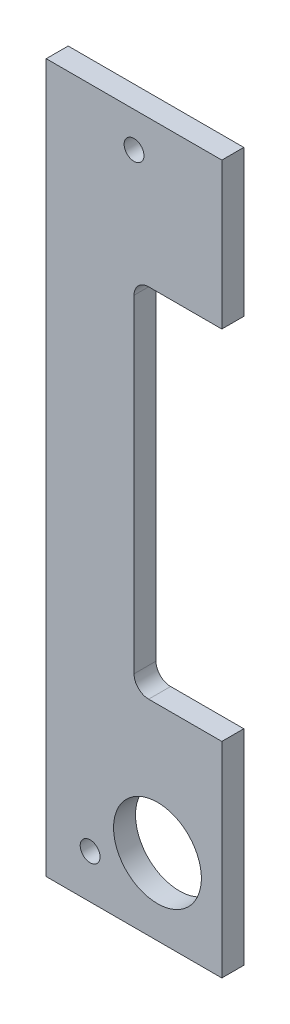
ISO-10303-21;
HEADER;
FILE_DESCRIPTION(('STEP AP214'),'2;1');
FILE_NAME('part.step','',(''),(''),'','','');
FILE_SCHEMA(('AUTOMOTIVE_DESIGN { 1 0 10303 214 1 1 1 1 }'));
ENDSEC;
DATA;
#1=APPLICATION_CONTEXT('core data for automotive mechanical design processes');
#2=APPLICATION_PROTOCOL_DEFINITION('international standard','automotive_design',2000,#1);
#3=PRODUCT_CONTEXT('',#1,'mechanical');
#4=PRODUCT('Part','Part','',(#3));
#5=PRODUCT_RELATED_PRODUCT_CATEGORY('part','',(#4));
#6=PRODUCT_DEFINITION_FORMATION('','',#4);
#7=PRODUCT_DEFINITION_CONTEXT('part definition',#1,'design');
#8=PRODUCT_DEFINITION('design','',#6,#7);
#9=PRODUCT_DEFINITION_SHAPE('','',#8);
#10=(LENGTH_UNIT() NAMED_UNIT(*) SI_UNIT(.MILLI.,.METRE.));
#11=(NAMED_UNIT(*) PLANE_ANGLE_UNIT() SI_UNIT($,.RADIAN.));
#12=(NAMED_UNIT(*) SI_UNIT($,.STERADIAN.) SOLID_ANGLE_UNIT());
#13=UNCERTAINTY_MEASURE_WITH_UNIT(LENGTH_MEASURE(1.E-05),#10,'distance_accuracy_value','');
#14=(GEOMETRIC_REPRESENTATION_CONTEXT(3) GLOBAL_UNCERTAINTY_ASSIGNED_CONTEXT((#13)) GLOBAL_UNIT_ASSIGNED_CONTEXT((#10,
#11,#12)) REPRESENTATION_CONTEXT('',''));
#15=CARTESIAN_POINT('',(0.,0.,0.));
#16=DIRECTION('',(0.,0.,1.));
#17=DIRECTION('',(1.,0.,0.));
#18=AXIS2_PLACEMENT_3D('',#15,#16,#17);
#19=CARTESIAN_POINT('',(0.,0.,-4.7625));
#20=DIRECTION('',(1.,0.,0.));
#21=DIRECTION('',(0.,1.,0.));
#22=AXIS2_PLACEMENT_3D('',#19,#20,#21);
#23=PLANE('',#22);
#24=DIRECTION('',(0.,1.,0.));
#25=VECTOR('',#24,1.);
#26=CARTESIAN_POINT('',(0.,0.,0.));
#27=LINE('',#26,#25);
#28=CARTESIAN_POINT('',(0.,0.,0.));
#29=VERTEX_POINT('',#28);
#30=CARTESIAN_POINT('',(0.,44.45,0.));
#31=VERTEX_POINT('',#30);
#32=EDGE_CURVE('E141',#29,#31,#27,.T.);
#33=ORIENTED_EDGE('',*,*,#32,.F.);
#34=DIRECTION('',(0.,0.,1.));
#35=VECTOR('',#34,1.);
#36=CARTESIAN_POINT('',(0.,0.,-4.7625));
#37=LINE('',#36,#35);
#38=CARTESIAN_POINT('',(0.,0.,-4.7625));
#39=VERTEX_POINT('',#38);
#40=EDGE_CURVE('E11',#39,#29,#37,.T.);
#41=ORIENTED_EDGE('',*,*,#40,.F.);
#42=DIRECTION('',(0.,1.,0.));
#43=VECTOR('',#42,1.);
#44=CARTESIAN_POINT('',(0.,0.,-4.7625));
#45=LINE('',#44,#43);
#46=CARTESIAN_POINT('',(0.,44.45,-4.7625));
#47=VERTEX_POINT('',#46);
#48=EDGE_CURVE('E168',#39,#47,#45,.T.);
#49=ORIENTED_EDGE('',*,*,#48,.T.);
#50=DIRECTION('',(0.,0.,1.));
#51=VECTOR('',#50,1.);
#52=CARTESIAN_POINT('',(0.,44.45,-4.7625));
#53=LINE('',#52,#51);
#54=EDGE_CURVE('E35',#47,#31,#53,.T.);
#55=ORIENTED_EDGE('',*,*,#54,.T.);
#56=EDGE_LOOP('',(#33,#41,#49,#55));
#57=FACE_BOUND('',#56,.T.);
#58=ADVANCED_FACE('F32',(#57),#23,.T.);
#59=CARTESIAN_POINT('',(-38.1,0.,-4.7625));
#60=DIRECTION('',(0.,-1.,0.));
#61=DIRECTION('',(1.,0.,0.));
#62=AXIS2_PLACEMENT_3D('',#59,#60,#61);
#63=PLANE('',#62);
#64=DIRECTION('',(1.,0.,0.));
#65=VECTOR('',#64,1.);
#66=CARTESIAN_POINT('',(-38.1,0.,0.));
#67=LINE('',#66,#65);
#68=CARTESIAN_POINT('',(-38.1,0.,0.));
#69=VERTEX_POINT('',#68);
#70=EDGE_CURVE('E166',#69,#29,#67,.T.);
#71=ORIENTED_EDGE('',*,*,#70,.F.);
#72=DIRECTION('',(0.,0.,1.));
#73=VECTOR('',#72,1.);
#74=CARTESIAN_POINT('',(-38.1,0.,-4.7625));
#75=LINE('',#74,#73);
#76=CARTESIAN_POINT('',(-38.1,0.,-4.7625));
#77=VERTEX_POINT('',#76);
#78=EDGE_CURVE('E41',#77,#69,#75,.T.);
#79=ORIENTED_EDGE('',*,*,#78,.F.);
#80=DIRECTION('',(1.,0.,0.));
#81=VECTOR('',#80,1.);
#82=CARTESIAN_POINT('',(-38.1,0.,-4.7625));
#83=LINE('',#82,#81);
#84=EDGE_CURVE('E131',#77,#39,#83,.T.);
#85=ORIENTED_EDGE('',*,*,#84,.T.);
#86=ORIENTED_EDGE('',*,*,#40,.T.);
#87=EDGE_LOOP('',(#71,#79,#85,#86));
#88=FACE_BOUND('',#87,.T.);
#89=ADVANCED_FACE('F184',(#88),#63,.T.);
#90=CARTESIAN_POINT('',(-38.1,153.67,-4.7625));
#91=DIRECTION('',(-1.,0.,0.));
#92=DIRECTION('',(0.,0.,1.));
#93=AXIS2_PLACEMENT_3D('',#90,#91,#92);
#94=PLANE('',#93);
#95=DIRECTION('',(0.,-1.,0.));
#96=VECTOR('',#95,1.);
#97=CARTESIAN_POINT('',(-38.1,153.67,0.));
#98=LINE('',#97,#96);
#99=CARTESIAN_POINT('',(-38.1,153.67,0.));
#100=VERTEX_POINT('',#99);
#101=EDGE_CURVE('E118',#100,#69,#98,.T.);
#102=ORIENTED_EDGE('',*,*,#101,.F.);
#103=DIRECTION('',(0.,0.,1.));
#104=VECTOR('',#103,1.);
#105=CARTESIAN_POINT('',(-38.1,153.67,-4.7625));
#106=LINE('',#105,#104);
#107=CARTESIAN_POINT('',(-38.1,153.67,-4.7625));
#108=VERTEX_POINT('',#107);
#109=EDGE_CURVE('E113',#108,#100,#106,.T.);
#110=ORIENTED_EDGE('',*,*,#109,.F.);
#111=DIRECTION('',(0.,-1.,0.));
#112=VECTOR('',#111,1.);
#113=CARTESIAN_POINT('',(-38.1,153.67,-4.7625));
#114=LINE('',#113,#112);
#115=EDGE_CURVE('E116',#108,#77,#114,.T.);
#116=ORIENTED_EDGE('',*,*,#115,.T.);
#117=ORIENTED_EDGE('',*,*,#78,.T.);
#118=EDGE_LOOP('',(#102,#110,#116,#117));
#119=FACE_BOUND('',#118,.T.);
#120=ADVANCED_FACE('F115',(#119),#94,.T.);
#121=CARTESIAN_POINT('',(0.,153.67,-4.7625));
#122=DIRECTION('',(0.,1.,0.));
#123=DIRECTION('',(0.,0.,1.));
#124=AXIS2_PLACEMENT_3D('',#121,#122,#123);
#125=PLANE('',#124);
#126=DIRECTION('',(-1.,0.,0.));
#127=VECTOR('',#126,1.);
#128=CARTESIAN_POINT('',(0.,153.67,0.));
#129=LINE('',#128,#127);
#130=CARTESIAN_POINT('',(0.,153.67,0.));
#131=VERTEX_POINT('',#130);
#132=EDGE_CURVE('E163',#131,#100,#129,.T.);
#133=ORIENTED_EDGE('',*,*,#132,.F.);
#134=DIRECTION('',(0.,0.,1.));
#135=VECTOR('',#134,1.);
#136=CARTESIAN_POINT('',(0.,153.67,-4.7625));
#137=LINE('',#136,#135);
#138=CARTESIAN_POINT('',(0.,153.67,-4.7625));
#139=VERTEX_POINT('',#138);
#140=EDGE_CURVE('E123',#139,#131,#137,.T.);
#141=ORIENTED_EDGE('',*,*,#140,.F.);
#142=DIRECTION('',(-1.,0.,0.));
#143=VECTOR('',#142,1.);
#144=CARTESIAN_POINT('',(0.,153.67,-4.7625));
#145=LINE('',#144,#143);
#146=EDGE_CURVE('E129',#139,#108,#145,.T.);
#147=ORIENTED_EDGE('',*,*,#146,.T.);
#148=ORIENTED_EDGE('',*,*,#109,.T.);
#149=EDGE_LOOP('',(#133,#141,#147,#148));
#150=FACE_BOUND('',#149,.T.);
#151=ADVANCED_FACE('F133',(#150),#125,.T.);
#152=CARTESIAN_POINT('',(0.,121.92,-4.7625));
#153=DIRECTION('',(1.,0.,0.));
#154=DIRECTION('',(0.,1.,0.));
#155=AXIS2_PLACEMENT_3D('',#152,#153,#154);
#156=PLANE('',#155);
#157=DIRECTION('',(0.,1.,0.));
#158=VECTOR('',#157,1.);
#159=CARTESIAN_POINT('',(0.,121.92,0.));
#160=LINE('',#159,#158);
#161=CARTESIAN_POINT('',(0.,121.92,0.));
#162=VERTEX_POINT('',#161);
#163=EDGE_CURVE('E160',#162,#131,#160,.T.);
#164=ORIENTED_EDGE('',*,*,#163,.F.);
#165=DIRECTION('',(0.,0.,1.));
#166=VECTOR('',#165,1.);
#167=CARTESIAN_POINT('',(0.,121.92,-4.7625));
#168=LINE('',#167,#166);
#169=CARTESIAN_POINT('',(0.,121.92,-4.7625));
#170=VERTEX_POINT('',#169);
#171=EDGE_CURVE('E172',#170,#162,#168,.T.);
#172=ORIENTED_EDGE('',*,*,#171,.F.);
#173=DIRECTION('',(0.,1.,0.));
#174=VECTOR('',#173,1.);
#175=CARTESIAN_POINT('',(0.,121.92,-4.7625));
#176=LINE('',#175,#174);
#177=EDGE_CURVE('E134',#170,#139,#176,.T.);
#178=ORIENTED_EDGE('',*,*,#177,.T.);
#179=ORIENTED_EDGE('',*,*,#140,.T.);
#180=EDGE_LOOP('',(#164,#172,#178,#179));
#181=FACE_BOUND('',#180,.T.);
#182=ADVANCED_FACE('F197',(#181),#156,.T.);
#183=CARTESIAN_POINT('',(-15.875,121.92,-4.7625));
#184=DIRECTION('',(0.,-1.,0.));
#185=DIRECTION('',(0.,0.,-1.));
#186=AXIS2_PLACEMENT_3D('',#183,#184,#185);
#187=PLANE('',#186);
#188=DIRECTION('',(1.,0.,0.));
#189=VECTOR('',#188,1.);
#190=CARTESIAN_POINT('',(-15.875,121.92,0.));
#191=LINE('',#190,#189);
#192=CARTESIAN_POINT('',(-15.875,121.92,0.));
#193=VERTEX_POINT('',#192);
#194=EDGE_CURVE('E157',#193,#162,#191,.T.);
#195=ORIENTED_EDGE('',*,*,#194,.F.);
#196=DIRECTION('',(0.,0.,1.));
#197=VECTOR('',#196,1.);
#198=CARTESIAN_POINT('',(-15.875,121.92,-4.7625));
#199=LINE('',#198,#197);
#200=CARTESIAN_POINT('',(-15.875,121.92,-4.7625));
#201=VERTEX_POINT('',#200);
#202=EDGE_CURVE('E174',#201,#193,#199,.T.);
#203=ORIENTED_EDGE('',*,*,#202,.F.);
#204=DIRECTION('',(1.,0.,0.));
#205=VECTOR('',#204,1.);
#206=CARTESIAN_POINT('',(-15.875,121.92,-4.7625));
#207=LINE('',#206,#205);
#208=EDGE_CURVE('E136',#201,#170,#207,.T.);
#209=ORIENTED_EDGE('',*,*,#208,.T.);
#210=ORIENTED_EDGE('',*,*,#171,.T.);
#211=EDGE_LOOP('',(#195,#203,#209,#210));
#212=FACE_BOUND('',#211,.T.);
#213=ADVANCED_FACE('F200',(#212),#187,.T.);
#214=CARTESIAN_POINT('',(-15.875,118.745,-4.7625));
#215=DIRECTION('',(0.,0.,1.));
#216=DIRECTION('',(1.,0.,0.));
#217=AXIS2_PLACEMENT_3D('',#214,#215,#216);
#218=CYLINDRICAL_SURFACE('',#217,3.175);
#219=CARTESIAN_POINT('',(-15.875,118.745,0.));
#220=DIRECTION('',(0.,0.,-1.));
#221=DIRECTION('',(1.,0.,0.));
#222=AXIS2_PLACEMENT_3D('',#219,#220,#221);
#223=CIRCLE('',#222,3.175);
#224=CARTESIAN_POINT('',(-19.05,118.745,0.));
#225=VERTEX_POINT('',#224);
#226=EDGE_CURVE('E154',#225,#193,#223,.T.);
#227=ORIENTED_EDGE('',*,*,#226,.F.);
#228=DIRECTION('',(0.,0.,1.));
#229=VECTOR('',#228,1.);
#230=CARTESIAN_POINT('',(-19.05,118.745,-4.7625));
#231=LINE('',#230,#229);
#232=CARTESIAN_POINT('',(-19.05,118.745,-4.7625));
#233=VERTEX_POINT('',#232);
#234=EDGE_CURVE('E176',#233,#225,#231,.T.);
#235=ORIENTED_EDGE('',*,*,#234,.F.);
#236=CARTESIAN_POINT('',(-15.875,118.745,-4.7625));
#237=DIRECTION('',(0.,0.,-1.));
#238=DIRECTION('',(1.,0.,0.));
#239=AXIS2_PLACEMENT_3D('',#236,#237,#238);
#240=CIRCLE('',#239,3.175);
#241=EDGE_CURVE('E270',#233,#201,#240,.T.);
#242=ORIENTED_EDGE('',*,*,#241,.T.);
#243=ORIENTED_EDGE('',*,*,#202,.T.);
#244=EDGE_LOOP('',(#227,#235,#242,#243));
#245=FACE_BOUND('',#244,.T.);
#246=ADVANCED_FACE('F204',(#245),#218,.F.);
#247=CARTESIAN_POINT('',(-19.05,47.625,-4.7625));
#248=DIRECTION('',(1.,0.,0.));
#249=DIRECTION('',(0.,1.,0.));
#250=AXIS2_PLACEMENT_3D('',#247,#248,#249);
#251=PLANE('',#250);
#252=DIRECTION('',(0.,1.,0.));
#253=VECTOR('',#252,1.);
#254=CARTESIAN_POINT('',(-19.05,47.625,0.));
#255=LINE('',#254,#253);
#256=CARTESIAN_POINT('',(-19.05,47.625,0.));
#257=VERTEX_POINT('',#256);
#258=EDGE_CURVE('E151',#257,#225,#255,.T.);
#259=ORIENTED_EDGE('',*,*,#258,.F.);
#260=DIRECTION('',(0.,0.,1.));
#261=VECTOR('',#260,1.);
#262=CARTESIAN_POINT('',(-19.05,47.625,-4.7625));
#263=LINE('',#262,#261);
#264=CARTESIAN_POINT('',(-19.05,47.625,-4.7625));
#265=VERTEX_POINT('',#264);
#266=EDGE_CURVE('E178',#265,#257,#263,.T.);
#267=ORIENTED_EDGE('',*,*,#266,.F.);
#268=DIRECTION('',(0.,1.,0.));
#269=VECTOR('',#268,1.);
#270=CARTESIAN_POINT('',(-19.05,47.625,-4.7625));
#271=LINE('',#270,#269);
#272=EDGE_CURVE('E267',#265,#233,#271,.T.);
#273=ORIENTED_EDGE('',*,*,#272,.T.);
#274=ORIENTED_EDGE('',*,*,#234,.T.);
#275=EDGE_LOOP('',(#259,#267,#273,#274));
#276=FACE_BOUND('',#275,.T.);
#277=ADVANCED_FACE('F208',(#276),#251,.T.);
#278=CARTESIAN_POINT('',(-15.875,47.625,-4.7625));
#279=DIRECTION('',(0.,0.,1.));
#280=DIRECTION('',(1.,0.,0.));
#281=AXIS2_PLACEMENT_3D('',#278,#279,#280);
#282=CYLINDRICAL_SURFACE('',#281,3.175);
#283=CARTESIAN_POINT('',(-15.875,47.625,0.));
#284=DIRECTION('',(0.,0.,-1.));
#285=DIRECTION('',(1.,0.,0.));
#286=AXIS2_PLACEMENT_3D('',#283,#284,#285);
#287=CIRCLE('',#286,3.175);
#288=CARTESIAN_POINT('',(-15.875,44.45,0.));
#289=VERTEX_POINT('',#288);
#290=EDGE_CURVE('E148',#289,#257,#287,.T.);
#291=ORIENTED_EDGE('',*,*,#290,.F.);
#292=DIRECTION('',(0.,0.,1.));
#293=VECTOR('',#292,1.);
#294=CARTESIAN_POINT('',(-15.875,44.45,-4.7625));
#295=LINE('',#294,#293);
#296=CARTESIAN_POINT('',(-15.875,44.45,-4.7625));
#297=VERTEX_POINT('',#296);
#298=EDGE_CURVE('E179',#297,#289,#295,.T.);
#299=ORIENTED_EDGE('',*,*,#298,.F.);
#300=CARTESIAN_POINT('',(-15.875,47.625,-4.7625));
#301=DIRECTION('',(0.,0.,-1.));
#302=DIRECTION('',(1.,0.,0.));
#303=AXIS2_PLACEMENT_3D('',#300,#301,#302);
#304=CIRCLE('',#303,3.175);
#305=EDGE_CURVE('E264',#297,#265,#304,.T.);
#306=ORIENTED_EDGE('',*,*,#305,.T.);
#307=ORIENTED_EDGE('',*,*,#266,.T.);
#308=EDGE_LOOP('',(#291,#299,#306,#307));
#309=FACE_BOUND('',#308,.T.);
#310=ADVANCED_FACE('F212',(#309),#282,.F.);
#311=CARTESIAN_POINT('',(0.,44.45,-4.7625));
#312=DIRECTION('',(0.,1.,0.));
#313=DIRECTION('',(0.,0.,1.));
#314=AXIS2_PLACEMENT_3D('',#311,#312,#313);
#315=PLANE('',#314);
#316=DIRECTION('',(-1.,0.,0.));
#317=VECTOR('',#316,1.);
#318=CARTESIAN_POINT('',(0.,44.45,0.));
#319=LINE('',#318,#317);
#320=EDGE_CURVE('E144',#31,#289,#319,.T.);
#321=ORIENTED_EDGE('',*,*,#320,.F.);
#322=ORIENTED_EDGE('',*,*,#54,.F.);
#323=DIRECTION('',(-1.,0.,0.));
#324=VECTOR('',#323,1.);
#325=CARTESIAN_POINT('',(0.,44.45,-4.7625));
#326=LINE('',#325,#324);
#327=EDGE_CURVE('E262',#47,#297,#326,.T.);
#328=ORIENTED_EDGE('',*,*,#327,.T.);
#329=ORIENTED_EDGE('',*,*,#298,.T.);
#330=EDGE_LOOP('',(#321,#322,#328,#329));
#331=FACE_BOUND('',#330,.T.);
#332=ADVANCED_FACE('F181',(#331),#315,.T.);
#333=CARTESIAN_POINT('',(-15.875,47.625,-4.7625));
#334=DIRECTION('',(0.,0.,1.));
#335=DIRECTION('',(1.,0.,0.));
#336=AXIS2_PLACEMENT_3D('',#333,#334,#335);
#337=PLANE('',#336);
#338=CARTESIAN_POINT('',(-13.97,16.51,-4.7625));
#339=DIRECTION('',(0.,0.,-1.));
#340=DIRECTION('',(-1.,0.,0.));
#341=AXIS2_PLACEMENT_3D('',#338,#339,#340);
#342=CIRCLE('',#341,9.525);
#343=CARTESIAN_POINT('',(-23.495,16.51,-4.7625));
#344=VERTEX_POINT('',#343);
#345=EDGE_CURVE('E246',#344,#344,#342,.T.);
#346=ORIENTED_EDGE('',*,*,#345,.F.);
#347=EDGE_LOOP('',(#346));
#348=FACE_BOUND('',#347,.T.);
#349=CARTESIAN_POINT('',(-28.575,9.525,-4.7625));
#350=DIRECTION('',(0.,0.,-1.));
#351=DIRECTION('',(-1.,0.,0.));
#352=AXIS2_PLACEMENT_3D('',#349,#350,#351);
#353=CIRCLE('',#352,2.15264999999999);
#354=CARTESIAN_POINT('',(-30.72765,9.525,-4.7625));
#355=VERTEX_POINT('',#354);
#356=EDGE_CURVE('E248',#355,#355,#353,.T.);
#357=ORIENTED_EDGE('',*,*,#356,.F.);
#358=EDGE_LOOP('',(#357));
#359=FACE_BOUND('',#358,.T.);
#360=CARTESIAN_POINT('',(-19.05,146.05,-4.7625));
#361=DIRECTION('',(0.,0.,-1.));
#362=DIRECTION('',(-1.,0.,0.));
#363=AXIS2_PLACEMENT_3D('',#360,#361,#362);
#364=CIRCLE('',#363,2.15264999999999);
#365=CARTESIAN_POINT('',(-21.20265,146.05,-4.7625));
#366=VERTEX_POINT('',#365);
#367=EDGE_CURVE('E256',#366,#366,#364,.T.);
#368=ORIENTED_EDGE('',*,*,#367,.F.);
#369=EDGE_LOOP('',(#368));
#370=FACE_BOUND('',#369,.T.);
#371=ORIENTED_EDGE('',*,*,#48,.F.);
#372=ORIENTED_EDGE('',*,*,#84,.F.);
#373=ORIENTED_EDGE('',*,*,#115,.F.);
#374=ORIENTED_EDGE('',*,*,#146,.F.);
#375=ORIENTED_EDGE('',*,*,#177,.F.);
#376=ORIENTED_EDGE('',*,*,#208,.F.);
#377=ORIENTED_EDGE('',*,*,#241,.F.);
#378=ORIENTED_EDGE('',*,*,#272,.F.);
#379=ORIENTED_EDGE('',*,*,#305,.F.);
#380=ORIENTED_EDGE('',*,*,#327,.F.);
#381=EDGE_LOOP('',(#371,#372,#373,#374,#375,#376,#377,#378,#379,#380));
#382=FACE_BOUND('',#381,.T.);
#383=ADVANCED_FACE('F127',(#348,#359,#370,#382),#337,.F.);
#384=CARTESIAN_POINT('',(-15.875,47.625,0.));
#385=DIRECTION('',(0.,0.,1.));
#386=DIRECTION('',(1.,0.,0.));
#387=AXIS2_PLACEMENT_3D('',#384,#385,#386);
#388=PLANE('',#387);
#389=CARTESIAN_POINT('',(-13.97,16.51,0.));
#390=DIRECTION('',(0.,0.,-1.));
#391=DIRECTION('',(-1.,0.,0.));
#392=AXIS2_PLACEMENT_3D('',#389,#390,#391);
#393=CIRCLE('',#392,9.525);
#394=CARTESIAN_POINT('',(-23.495,16.51,0.));
#395=VERTEX_POINT('',#394);
#396=EDGE_CURVE('E244',#395,#395,#393,.T.);
#397=ORIENTED_EDGE('',*,*,#396,.T.);
#398=EDGE_LOOP('',(#397));
#399=FACE_BOUND('',#398,.T.);
#400=CARTESIAN_POINT('',(-28.575,9.525,0.));
#401=DIRECTION('',(0.,0.,-1.));
#402=DIRECTION('',(-1.,0.,0.));
#403=AXIS2_PLACEMENT_3D('',#400,#401,#402);
#404=CIRCLE('',#403,2.15265);
#405=CARTESIAN_POINT('',(-30.72765,9.525,0.));
#406=VERTEX_POINT('',#405);
#407=EDGE_CURVE('E253',#406,#406,#404,.T.);
#408=ORIENTED_EDGE('',*,*,#407,.T.);
#409=EDGE_LOOP('',(#408));
#410=FACE_BOUND('',#409,.T.);
#411=CARTESIAN_POINT('',(-19.05,146.05,0.));
#412=DIRECTION('',(0.,0.,-1.));
#413=DIRECTION('',(-1.,0.,0.));
#414=AXIS2_PLACEMENT_3D('',#411,#412,#413);
#415=CIRCLE('',#414,2.15265);
#416=CARTESIAN_POINT('',(-21.20265,146.05,0.));
#417=VERTEX_POINT('',#416);
#418=EDGE_CURVE('E145',#417,#417,#415,.T.);
#419=ORIENTED_EDGE('',*,*,#418,.T.);
#420=EDGE_LOOP('',(#419));
#421=FACE_BOUND('',#420,.T.);
#422=ORIENTED_EDGE('',*,*,#32,.T.);
#423=ORIENTED_EDGE('',*,*,#320,.T.);
#424=ORIENTED_EDGE('',*,*,#290,.T.);
#425=ORIENTED_EDGE('',*,*,#258,.T.);
#426=ORIENTED_EDGE('',*,*,#226,.T.);
#427=ORIENTED_EDGE('',*,*,#194,.T.);
#428=ORIENTED_EDGE('',*,*,#163,.T.);
#429=ORIENTED_EDGE('',*,*,#132,.T.);
#430=ORIENTED_EDGE('',*,*,#101,.T.);
#431=ORIENTED_EDGE('',*,*,#70,.T.);
#432=EDGE_LOOP('',(#422,#423,#424,#425,#426,#427,#428,#429,#430,#431));
#433=FACE_BOUND('',#432,.T.);
#434=ADVANCED_FACE('F183',(#399,#410,#421,#433),#388,.T.);
#435=CARTESIAN_POINT('',(-19.05,146.05,-4.7625));
#436=DIRECTION('',(0.,0.,-1.));
#437=DIRECTION('',(-1.,0.,0.));
#438=AXIS2_PLACEMENT_3D('',#435,#436,#437);
#439=CYLINDRICAL_SURFACE('',#438,2.15264999999999);
#440=ORIENTED_EDGE('',*,*,#418,.F.);
#441=EDGE_LOOP('',(#440));
#442=FACE_BOUND('',#441,.T.);
#443=ORIENTED_EDGE('',*,*,#367,.T.);
#444=EDGE_LOOP('',(#443));
#445=FACE_BOUND('',#444,.T.);
#446=ADVANCED_FACE('F224',(#442,#445),#439,.F.);
#447=CARTESIAN_POINT('',(-28.575,9.525,-4.7625));
#448=DIRECTION('',(0.,0.,-1.));
#449=DIRECTION('',(-1.,0.,0.));
#450=AXIS2_PLACEMENT_3D('',#447,#448,#449);
#451=CYLINDRICAL_SURFACE('',#450,2.15264999999999);
#452=ORIENTED_EDGE('',*,*,#407,.F.);
#453=EDGE_LOOP('',(#452));
#454=FACE_BOUND('',#453,.T.);
#455=ORIENTED_EDGE('',*,*,#356,.T.);
#456=EDGE_LOOP('',(#455));
#457=FACE_BOUND('',#456,.T.);
#458=ADVANCED_FACE('F231',(#454,#457),#451,.F.);
#459=CARTESIAN_POINT('',(-13.97,16.51,-4.7625));
#460=DIRECTION('',(0.,0.,-1.));
#461=DIRECTION('',(-1.,0.,0.));
#462=AXIS2_PLACEMENT_3D('',#459,#460,#461);
#463=CYLINDRICAL_SURFACE('',#462,9.525);
#464=ORIENTED_EDGE('',*,*,#396,.F.);
#465=EDGE_LOOP('',(#464));
#466=FACE_BOUND('',#465,.T.);
#467=ORIENTED_EDGE('',*,*,#345,.T.);
#468=EDGE_LOOP('',(#467));
#469=FACE_BOUND('',#468,.T.);
#470=ADVANCED_FACE('F235',(#466,#469),#463,.F.);
#471=CLOSED_SHELL('',(#58,#89,#120,#151,#182,#213,#246,#277,#310,#332,#383,#434,#446,#458,#470));
#472=MANIFOLD_SOLID_BREP('B2',#471);
#473=ADVANCED_BREP_SHAPE_REPRESENTATION('',(#18,#472),#14);
#474=SHAPE_DEFINITION_REPRESENTATION(#9,#473);
ENDSEC;
END-ISO-10303-21;
